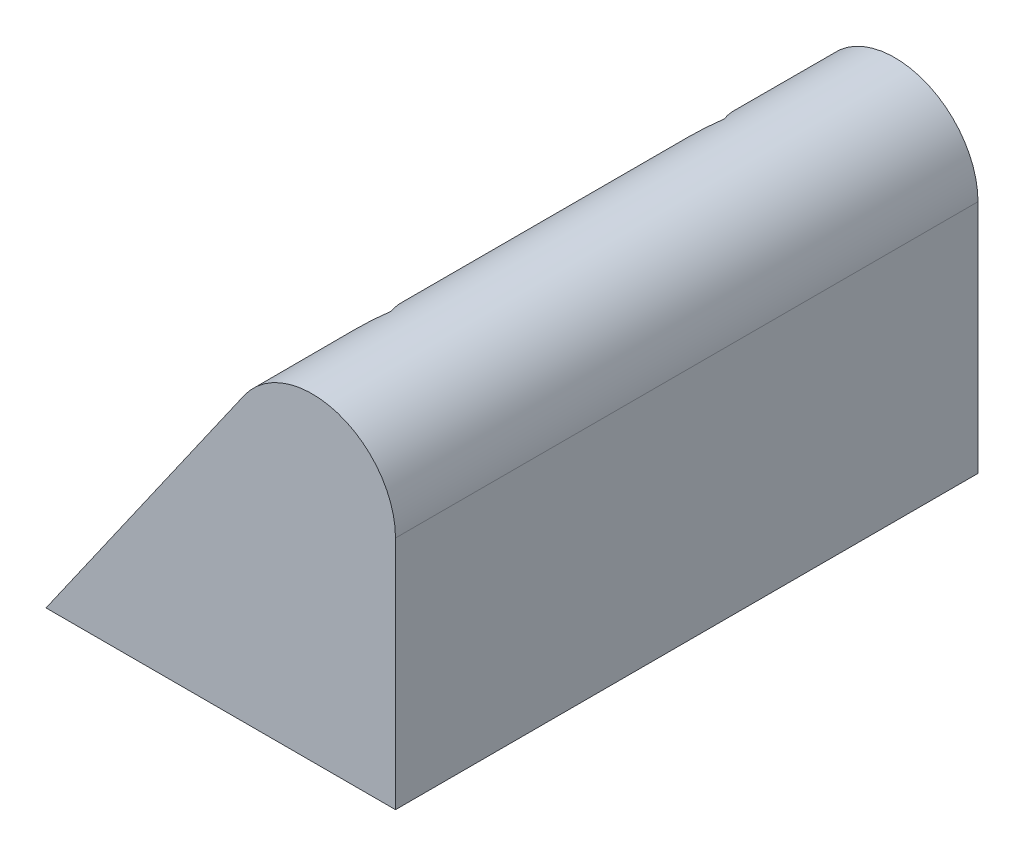
ISO-10303-21;
HEADER;
FILE_DESCRIPTION(('STEP AP214'),'2;1');
FILE_NAME('part.step','',(''),(''),'','','');
FILE_SCHEMA(('AUTOMOTIVE_DESIGN { 1 0 10303 214 1 1 1 1 }'));
ENDSEC;
DATA;
#1=APPLICATION_CONTEXT('core data for automotive mechanical design processes');
#2=APPLICATION_PROTOCOL_DEFINITION('international standard','automotive_design',2000,#1);
#3=PRODUCT_CONTEXT('',#1,'mechanical');
#4=PRODUCT('Part','Part','',(#3));
#5=PRODUCT_RELATED_PRODUCT_CATEGORY('part','',(#4));
#6=PRODUCT_DEFINITION_FORMATION('','',#4);
#7=PRODUCT_DEFINITION_CONTEXT('part definition',#1,'design');
#8=PRODUCT_DEFINITION('design','',#6,#7);
#9=PRODUCT_DEFINITION_SHAPE('','',#8);
#10=(LENGTH_UNIT() NAMED_UNIT(*) SI_UNIT(.MILLI.,.METRE.));
#11=(NAMED_UNIT(*) PLANE_ANGLE_UNIT() SI_UNIT($,.RADIAN.));
#12=(NAMED_UNIT(*) SI_UNIT($,.STERADIAN.) SOLID_ANGLE_UNIT());
#13=UNCERTAINTY_MEASURE_WITH_UNIT(LENGTH_MEASURE(1.E-05),#10,'distance_accuracy_value','');
#14=(GEOMETRIC_REPRESENTATION_CONTEXT(3) GLOBAL_UNCERTAINTY_ASSIGNED_CONTEXT((#13)) GLOBAL_UNIT_ASSIGNED_CONTEXT((#10,
#11,#12)) REPRESENTATION_CONTEXT('',''));
#15=CARTESIAN_POINT('',(0.,0.,0.));
#16=DIRECTION('',(0.,0.,1.));
#17=DIRECTION('',(1.,0.,0.));
#18=AXIS2_PLACEMENT_3D('',#15,#16,#17);
#19=CARTESIAN_POINT('',(21.,0.,35.));
#20=DIRECTION('',(0.,1.,0.));
#21=DIRECTION('',(-1.,0.,0.));
#22=AXIS2_PLACEMENT_3D('',#19,#20,#21);
#23=PLANE('',#22);
#24=CARTESIAN_POINT('',(10.,0.,27.5));
#25=DIRECTION('',(0.,-1.,0.));
#26=DIRECTION('',(1.,0.,0.));
#27=AXIS2_PLACEMENT_3D('',#24,#25,#26);
#28=CIRCLE('',#27,1.6);
#29=CARTESIAN_POINT('',(11.6,0.,27.5));
#30=VERTEX_POINT('',#29);
#31=EDGE_CURVE('E234',#30,#30,#28,.T.);
#32=ORIENTED_EDGE('',*,*,#31,.F.);
#33=EDGE_LOOP('',(#32));
#34=FACE_BOUND('',#33,.T.);
#35=CARTESIAN_POINT('',(10.,0.,7.5));
#36=DIRECTION('',(0.,-1.,0.));
#37=DIRECTION('',(-1.,0.,0.));
#38=AXIS2_PLACEMENT_3D('',#35,#36,#37);
#39=CIRCLE('',#38,1.6);
#40=CARTESIAN_POINT('',(8.4,0.,7.5));
#41=VERTEX_POINT('',#40);
#42=EDGE_CURVE('E238',#41,#41,#39,.T.);
#43=ORIENTED_EDGE('',*,*,#42,.F.);
#44=EDGE_LOOP('',(#43));
#45=FACE_BOUND('',#44,.T.);
#46=DIRECTION('',(1.,0.,0.));
#47=VECTOR('',#46,1.);
#48=CARTESIAN_POINT('',(21.,0.,0.));
#49=LINE('',#48,#47);
#50=CARTESIAN_POINT('',(0.,0.,0.));
#51=VERTEX_POINT('',#50);
#52=CARTESIAN_POINT('',(21.,0.,0.));
#53=VERTEX_POINT('',#52);
#54=EDGE_CURVE('E237',#51,#53,#49,.T.);
#55=ORIENTED_EDGE('',*,*,#54,.T.);
#56=DIRECTION('',(0.,0.,-1.));
#57=VECTOR('',#56,1.);
#58=CARTESIAN_POINT('',(21.,0.,35.));
#59=LINE('',#58,#57);
#60=CARTESIAN_POINT('',(21.,0.,35.));
#61=VERTEX_POINT('',#60);
#62=EDGE_CURVE('E258',#61,#53,#59,.T.);
#63=ORIENTED_EDGE('',*,*,#62,.F.);
#64=DIRECTION('',(1.,0.,0.));
#65=VECTOR('',#64,1.);
#66=CARTESIAN_POINT('',(21.,0.,35.));
#67=LINE('',#66,#65);
#68=CARTESIAN_POINT('',(0.,0.,35.));
#69=VERTEX_POINT('',#68);
#70=EDGE_CURVE('E242',#69,#61,#67,.T.);
#71=ORIENTED_EDGE('',*,*,#70,.F.);
#72=DIRECTION('',(0.,0.,-1.));
#73=VECTOR('',#72,1.);
#74=CARTESIAN_POINT('',(0.,0.,35.));
#75=LINE('',#74,#73);
#76=EDGE_CURVE('E250',#69,#51,#75,.T.);
#77=ORIENTED_EDGE('',*,*,#76,.T.);
#78=EDGE_LOOP('',(#55,#63,#71,#77));
#79=FACE_BOUND('',#78,.T.);
#80=ADVANCED_FACE('F33',(#34,#45,#79),#23,.F.);
#81=CARTESIAN_POINT('',(21.,30.,35.));
#82=DIRECTION('',(-1.,0.,0.));
#83=DIRECTION('',(0.,-1.,0.));
#84=AXIS2_PLACEMENT_3D('',#81,#82,#83);
#85=PLANE('',#84);
#86=DIRECTION('',(0.,1.,0.));
#87=VECTOR('',#86,1.);
#88=CARTESIAN_POINT('',(21.,30.,0.));
#89=LINE('',#88,#87);
#90=CARTESIAN_POINT('',(21.,14.1381745601902,0.));
#91=VERTEX_POINT('',#90);
#92=EDGE_CURVE('E253',#53,#91,#89,.T.);
#93=ORIENTED_EDGE('',*,*,#92,.T.);
#94=DIRECTION('',(0.,0.,-1.));
#95=VECTOR('',#94,1.);
#96=CARTESIAN_POINT('',(21.,14.1381745601902,35.));
#97=LINE('',#96,#95);
#98=CARTESIAN_POINT('',(21.,14.1381745601902,35.));
#99=VERTEX_POINT('',#98);
#100=EDGE_CURVE('E41',#91,#99,#97,.F.);
#101=ORIENTED_EDGE('',*,*,#100,.T.);
#102=DIRECTION('',(0.,1.,0.));
#103=VECTOR('',#102,1.);
#104=CARTESIAN_POINT('',(21.,30.,35.));
#105=LINE('',#104,#103);
#106=EDGE_CURVE('E245',#61,#99,#105,.T.);
#107=ORIENTED_EDGE('',*,*,#106,.F.);
#108=ORIENTED_EDGE('',*,*,#62,.T.);
#109=EDGE_LOOP('',(#93,#101,#107,#108));
#110=FACE_BOUND('',#109,.T.);
#111=ADVANCED_FACE('F333',(#110),#85,.F.);
#112=CARTESIAN_POINT('',(0.,0.,35.));
#113=DIRECTION('',(0.81923192051904,-0.573462344363328,0.));
#114=DIRECTION('',(0.573462344363328,0.81923192051904,0.));
#115=AXIS2_PLACEMENT_3D('',#112,#113,#114);
#116=PLANE('',#115);
#117=DIRECTION('',(-0.573462344363328,-0.81923192051904,0.));
#118=VECTOR('',#117,1.);
#119=CARTESIAN_POINT('',(0.,0.,35.));
#120=LINE('',#119,#118);
#121=CARTESIAN_POINT('',(11.9038403974048,17.0054862820068,35.));
#122=VERTEX_POINT('',#121);
#123=EDGE_CURVE('E248',#122,#69,#120,.T.);
#124=ORIENTED_EDGE('',*,*,#123,.F.);
#125=DIRECTION('',(0.,0.,-1.));
#126=VECTOR('',#125,1.);
#127=CARTESIAN_POINT('',(11.9038403974048,17.0054862820069,35.));
#128=LINE('',#127,#126);
#129=CARTESIAN_POINT('',(11.9038403974048,17.0054862820068,29.8024517021928));
#130=VERTEX_POINT('',#129);
#131=EDGE_CURVE('E303',#122,#130,#128,.T.);
#132=ORIENTED_EDGE('',*,*,#131,.T.);
#133=DIRECTION('',(-0.406866735603367,-0.581238193719096,0.704713857974726));
#134=VECTOR('',#133,1.);
#135=CARTESIAN_POINT('',(4.42143942505182,6.31634203578831,42.7623503489109));
#136=LINE('',#135,#134);
#137=CARTESIAN_POINT('',(11.616580753731,16.5951153624728,30.3));
#138=VERTEX_POINT('',#137);
#139=EDGE_CURVE('E282',#130,#138,#136,.T.);
#140=ORIENTED_EDGE('',*,*,#139,.T.);
#141=DIRECTION('',(-0.573462344363328,-0.81923192051904,0.));
#142=VECTOR('',#141,1.);
#143=CARTESIAN_POINT('',(0.,0.,30.3));
#144=LINE('',#143,#142);
#145=CARTESIAN_POINT('',(8.38341924626905,11.9763132089558,30.3));
#146=VERTEX_POINT('',#145);
#147=EDGE_CURVE('E284',#138,#146,#144,.T.);
#148=ORIENTED_EDGE('',*,*,#147,.T.);
#149=DIRECTION('',(-0.406866735603367,-0.581238193719096,-0.704713857974726));
#150=VECTOR('',#149,1.);
#151=CARTESIAN_POINT('',(5.51099300738062,7.87284715340088,25.3248118132513));
#152=LINE('',#151,#150);
#153=CARTESIAN_POINT('',(6.76683849253809,9.66691213219728,27.5));
#154=VERTEX_POINT('',#153);
#155=EDGE_CURVE('E287',#146,#154,#152,.T.);
#156=ORIENTED_EDGE('',*,*,#155,.T.);
#157=DIRECTION('',(0.406866735603367,0.581238193719096,-0.704713857974726));
#158=VECTOR('',#157,1.);
#159=CARTESIAN_POINT('',(1.21012360345114,1.7287480049302,37.1245125110731));
#160=LINE('',#159,#158);
#161=CARTESIAN_POINT('',(8.38341924626904,11.9763132089558,24.7));
#162=VERTEX_POINT('',#161);
#163=EDGE_CURVE('E290',#154,#162,#160,.T.);
#164=ORIENTED_EDGE('',*,*,#163,.T.);
#165=DIRECTION('',(0.573462344363328,0.81923192051904,0.));
#166=VECTOR('',#165,1.);
#167=CARTESIAN_POINT('',(0.,0.,24.7));
#168=LINE('',#167,#166);
#169=CARTESIAN_POINT('',(11.6165807537309,16.5951153624728,24.7));
#170=VERTEX_POINT('',#169);
#171=EDGE_CURVE('E293',#162,#170,#168,.T.);
#172=ORIENTED_EDGE('',*,*,#171,.T.);
#173=DIRECTION('',(0.406866735603368,0.581238193719097,0.704713857974725));
#174=VECTOR('',#173,1.);
#175=CARTESIAN_POINT('',(8.72230882898128,12.460441184259,19.6869739754134));
#176=LINE('',#175,#174);
#177=CARTESIAN_POINT('',(11.9038403974048,17.0054862820069,25.1975482978072));
#178=VERTEX_POINT('',#177);
#179=EDGE_CURVE('E296',#170,#178,#176,.T.);
#180=ORIENTED_EDGE('',*,*,#179,.T.);
#181=DIRECTION('',(0.,0.,-1.));
#182=VECTOR('',#181,1.);
#183=CARTESIAN_POINT('',(11.9038403974048,17.0054862820069,35.));
#184=LINE('',#183,#182);
#185=CARTESIAN_POINT('',(11.9038403974048,17.0054862820069,9.80245170219278));
#186=VERTEX_POINT('',#185);
#187=EDGE_CURVE('E301',#178,#186,#184,.T.);
#188=ORIENTED_EDGE('',*,*,#187,.T.);
#189=DIRECTION('',(-0.406866735603367,-0.581238193719095,0.704713857974727));
#190=VECTOR('',#189,1.);
#191=CARTESIAN_POINT('',(-1.31305311352079,-1.87579016217256,32.6947827813434));
#192=LINE('',#191,#190);
#193=CARTESIAN_POINT('',(11.616580753731,16.5951153624728,10.3));
#194=VERTEX_POINT('',#193);
#195=EDGE_CURVE('E261',#186,#194,#192,.T.);
#196=ORIENTED_EDGE('',*,*,#195,.T.);
#197=DIRECTION('',(-0.573462344363328,-0.81923192051904,0.));
#198=VECTOR('',#197,1.);
#199=CARTESIAN_POINT('',(0.,0.,10.3));
#200=LINE('',#199,#198);
#201=CARTESIAN_POINT('',(8.38341924626905,11.9763132089558,10.3));
#202=VERTEX_POINT('',#201);
#203=EDGE_CURVE('E267',#194,#202,#200,.T.);
#204=ORIENTED_EDGE('',*,*,#203,.T.);
#205=DIRECTION('',(-0.406866735603368,-0.581238193719096,-0.704713857974726));
#206=VECTOR('',#205,1.);
#207=CARTESIAN_POINT('',(11.2454855459533,16.0649793513618,15.2572442456837));
#208=LINE('',#207,#206);
#209=CARTESIAN_POINT('',(6.76683849253809,9.66691213219728,7.5));
#210=VERTEX_POINT('',#209);
#211=EDGE_CURVE('E270',#202,#210,#208,.T.);
#212=ORIENTED_EDGE('',*,*,#211,.T.);
#213=DIRECTION('',(0.406866735603367,0.581238193719096,-0.704713857974726));
#214=VECTOR('',#213,1.);
#215=CARTESIAN_POINT('',(-4.52436893512149,-6.4633841930307,27.0569449435055));
#216=LINE('',#215,#214);
#217=CARTESIAN_POINT('',(8.38341924626904,11.9763132089558,4.7));
#218=VERTEX_POINT('',#217);
#219=EDGE_CURVE('E273',#210,#218,#216,.T.);
#220=ORIENTED_EDGE('',*,*,#219,.T.);
#221=DIRECTION('',(0.573462344363328,0.81923192051904,0.));
#222=VECTOR('',#221,1.);
#223=CARTESIAN_POINT('',(0.,0.,4.7));
#224=LINE('',#223,#222);
#225=CARTESIAN_POINT('',(11.616580753731,16.5951153624728,4.69999999999999));
#226=VERTEX_POINT('',#225);
#227=EDGE_CURVE('E276',#218,#226,#224,.T.);
#228=ORIENTED_EDGE('',*,*,#227,.T.);
#229=DIRECTION('',(0.406866735603368,0.581238193719096,0.704713857974725));
#230=VECTOR('',#229,1.);
#231=CARTESIAN_POINT('',(14.4568013675539,20.6525733822199,9.61940640784585));
#232=LINE('',#231,#230);
#233=CARTESIAN_POINT('',(11.9038403974048,17.0054862820068,5.19754829780722));
#234=VERTEX_POINT('',#233);
#235=EDGE_CURVE('E279',#226,#234,#232,.T.);
#236=ORIENTED_EDGE('',*,*,#235,.T.);
#237=DIRECTION('',(0.,0.,-1.));
#238=VECTOR('',#237,1.);
#239=CARTESIAN_POINT('',(11.9038403974048,17.0054862820069,35.));
#240=LINE('',#239,#238);
#241=CARTESIAN_POINT('',(11.9038403974048,17.0054862820068,0.));
#242=VERTEX_POINT('',#241);
#243=EDGE_CURVE('E299',#234,#242,#240,.T.);
#244=ORIENTED_EDGE('',*,*,#243,.T.);
#245=DIRECTION('',(-0.573462344363328,-0.81923192051904,0.));
#246=VECTOR('',#245,1.);
#247=CARTESIAN_POINT('',(0.,0.,0.));
#248=LINE('',#247,#246);
#249=EDGE_CURVE('E246',#242,#51,#248,.T.);
#250=ORIENTED_EDGE('',*,*,#249,.T.);
#251=ORIENTED_EDGE('',*,*,#76,.F.);
#252=EDGE_LOOP('',(#124,#132,#140,#148,#156,#164,#172,#180,#188,#196,#204,#212,#220,#228,#236,
#244,#250,#251));
#253=FACE_BOUND('',#252,.T.);
#254=ADVANCED_FACE('F323',(#253),#116,.F.);
#255=CARTESIAN_POINT('',(0.,0.,35.));
#256=DIRECTION('',(0.,0.,1.));
#257=DIRECTION('',(1.,0.,0.));
#258=AXIS2_PLACEMENT_3D('',#255,#256,#257);
#259=PLANE('',#258);
#260=ORIENTED_EDGE('',*,*,#106,.T.);
#261=CARTESIAN_POINT('',(16.,14.1381745601902,35.));
#262=DIRECTION('',(0.,0.,1.));
#263=DIRECTION('',(1.,0.,0.));
#264=AXIS2_PLACEMENT_3D('',#261,#262,#263);
#265=CIRCLE('',#264,5.);
#266=EDGE_CURVE('E11',#99,#122,#265,.T.);
#267=ORIENTED_EDGE('',*,*,#266,.T.);
#268=ORIENTED_EDGE('',*,*,#123,.T.);
#269=ORIENTED_EDGE('',*,*,#70,.T.);
#270=EDGE_LOOP('',(#260,#267,#268,#269));
#271=FACE_BOUND('',#270,.T.);
#272=ADVANCED_FACE('F327',(#271),#259,.T.);
#273=CARTESIAN_POINT('',(0.,0.,0.));
#274=DIRECTION('',(0.,0.,1.));
#275=DIRECTION('',(1.,0.,0.));
#276=AXIS2_PLACEMENT_3D('',#273,#274,#275);
#277=PLANE('',#276);
#278=ORIENTED_EDGE('',*,*,#249,.F.);
#279=CARTESIAN_POINT('',(16.,14.1381745601902,0.));
#280=DIRECTION('',(0.,0.,1.));
#281=DIRECTION('',(1.,0.,0.));
#282=AXIS2_PLACEMENT_3D('',#279,#280,#281);
#283=CIRCLE('',#282,5.);
#284=EDGE_CURVE('E55',#242,#91,#283,.F.);
#285=ORIENTED_EDGE('',*,*,#284,.T.);
#286=ORIENTED_EDGE('',*,*,#92,.F.);
#287=ORIENTED_EDGE('',*,*,#54,.F.);
#288=EDGE_LOOP('',(#278,#285,#286,#287));
#289=FACE_BOUND('',#288,.T.);
#290=ADVANCED_FACE('F334',(#289),#277,.F.);
#291=CARTESIAN_POINT('',(10.,30.,7.5));
#292=DIRECTION('',(0.,-1.,0.));
#293=DIRECTION('',(1.,0.,0.));
#294=AXIS2_PLACEMENT_3D('',#291,#292,#293);
#295=CYLINDRICAL_SURFACE('',#294,1.6);
#296=CARTESIAN_POINT('',(10.,3.,7.5));
#297=DIRECTION('',(0.,-1.,0.));
#298=DIRECTION('',(1.,0.,0.));
#299=AXIS2_PLACEMENT_3D('',#296,#297,#298);
#300=CIRCLE('',#299,1.6);
#301=CARTESIAN_POINT('',(11.6,3.,7.5));
#302=VERTEX_POINT('',#301);
#303=EDGE_CURVE('E241',#302,#302,#300,.F.);
#304=ORIENTED_EDGE('',*,*,#303,.T.);
#305=EDGE_LOOP('',(#304));
#306=FACE_BOUND('',#305,.T.);
#307=ORIENTED_EDGE('',*,*,#42,.T.);
#308=EDGE_LOOP('',(#307));
#309=FACE_BOUND('',#308,.T.);
#310=ADVANCED_FACE('F336',(#306,#309),#295,.F.);
#311=CARTESIAN_POINT('',(10.,30.,27.5));
#312=DIRECTION('',(0.,-1.,0.));
#313=DIRECTION('',(1.,0.,0.));
#314=AXIS2_PLACEMENT_3D('',#311,#312,#313);
#315=CYLINDRICAL_SURFACE('',#314,1.6);
#316=CARTESIAN_POINT('',(10.,3.,27.5));
#317=DIRECTION('',(0.,-1.,0.));
#318=DIRECTION('',(1.,0.,0.));
#319=AXIS2_PLACEMENT_3D('',#316,#317,#318);
#320=CIRCLE('',#319,1.6);
#321=CARTESIAN_POINT('',(11.6,3.,27.5));
#322=VERTEX_POINT('',#321);
#323=EDGE_CURVE('E199',#322,#322,#320,.F.);
#324=ORIENTED_EDGE('',*,*,#323,.T.);
#325=EDGE_LOOP('',(#324));
#326=FACE_BOUND('',#325,.T.);
#327=ORIENTED_EDGE('',*,*,#31,.T.);
#328=EDGE_LOOP('',(#327));
#329=FACE_BOUND('',#328,.T.);
#330=ADVANCED_FACE('F342',(#326,#329),#315,.F.);
#331=CARTESIAN_POINT('',(11.6165807537309,30.,24.7));
#332=DIRECTION('',(0.866025403784438,0.,-0.5));
#333=DIRECTION('',(-0.5,0.,-0.866025403784439));
#334=AXIS2_PLACEMENT_3D('',#331,#332,#333);
#335=PLANE('',#334);
#336=DIRECTION('',(0.,-1.,0.));
#337=VECTOR('',#336,1.);
#338=CARTESIAN_POINT('',(13.2331615074619,30.,27.5));
#339=LINE('',#338,#337);
#340=CARTESIAN_POINT('',(13.2331615074619,18.3028599932343,27.5));
#341=VERTEX_POINT('',#340);
#342=CARTESIAN_POINT('',(13.2331615074619,3.,27.5));
#343=VERTEX_POINT('',#342);
#344=EDGE_CURVE('E157',#341,#343,#339,.T.);
#345=ORIENTED_EDGE('',*,*,#344,.F.);
#346=CARTESIAN_POINT('',(16.,14.1381745601902,32.2923048454133));
#347=DIRECTION('',(0.866025403784438,0.,-0.5));
#348=DIRECTION('',(-0.5,0.,-0.866025403784439));
#349=AXIS2_PLACEMENT_3D('',#346,#347,#348);
#350=ELLIPSE('',#349,9.99999999999999,5.);
#351=EDGE_CURVE('E307',#341,#178,#350,.F.);
#352=ORIENTED_EDGE('',*,*,#351,.T.);
#353=ORIENTED_EDGE('',*,*,#179,.F.);
#354=DIRECTION('',(0.,-1.,0.));
#355=VECTOR('',#354,1.);
#356=CARTESIAN_POINT('',(11.6165807537309,30.,24.7));
#357=LINE('',#356,#355);
#358=CARTESIAN_POINT('',(11.6165807537309,3.,24.7));
#359=VERTEX_POINT('',#358);
#360=EDGE_CURVE('E184',#170,#359,#357,.T.);
#361=ORIENTED_EDGE('',*,*,#360,.T.);
#362=DIRECTION('',(0.5,0.,0.866025403784439));
#363=VECTOR('',#362,1.);
#364=CARTESIAN_POINT('',(11.6165807537309,3.,24.7));
#365=LINE('',#364,#363);
#366=EDGE_CURVE('E176',#359,#343,#365,.T.);
#367=ORIENTED_EDGE('',*,*,#366,.T.);
#368=EDGE_LOOP('',(#345,#352,#353,#361,#367));
#369=FACE_BOUND('',#368,.T.);
#370=ADVANCED_FACE('F182',(#369),#335,.F.);
#371=CARTESIAN_POINT('',(8.38341924626904,30.,24.7));
#372=DIRECTION('',(0.,0.,-1.));
#373=DIRECTION('',(-1.,0.,0.));
#374=AXIS2_PLACEMENT_3D('',#371,#372,#373);
#375=PLANE('',#374);
#376=DIRECTION('',(0.,-1.,0.));
#377=VECTOR('',#376,1.);
#378=CARTESIAN_POINT('',(8.38341924626904,30.,24.7));
#379=LINE('',#378,#377);
#380=CARTESIAN_POINT('',(8.38341924626904,3.,24.7));
#381=VERTEX_POINT('',#380);
#382=EDGE_CURVE('E200',#162,#381,#379,.T.);
#383=ORIENTED_EDGE('',*,*,#382,.T.);
#384=DIRECTION('',(1.,0.,0.));
#385=VECTOR('',#384,1.);
#386=CARTESIAN_POINT('',(8.38341924626904,3.,24.7));
#387=LINE('',#386,#385);
#388=EDGE_CURVE('E168',#381,#359,#387,.T.);
#389=ORIENTED_EDGE('',*,*,#388,.T.);
#390=ORIENTED_EDGE('',*,*,#360,.F.);
#391=ORIENTED_EDGE('',*,*,#171,.F.);
#392=EDGE_LOOP('',(#383,#389,#390,#391));
#393=FACE_BOUND('',#392,.T.);
#394=ADVANCED_FACE('F378',(#393),#375,.F.);
#395=CARTESIAN_POINT('',(6.76683849253809,30.,27.5));
#396=DIRECTION('',(-0.866025403784439,0.,-0.5));
#397=DIRECTION('',(-0.5,0.,0.866025403784439));
#398=AXIS2_PLACEMENT_3D('',#395,#396,#397);
#399=PLANE('',#398);
#400=DIRECTION('',(0.,-1.,0.));
#401=VECTOR('',#400,1.);
#402=CARTESIAN_POINT('',(6.76683849253809,30.,27.5));
#403=LINE('',#402,#401);
#404=CARTESIAN_POINT('',(6.76683849253809,3.,27.5));
#405=VERTEX_POINT('',#404);
#406=EDGE_CURVE('E202',#154,#405,#403,.T.);
#407=ORIENTED_EDGE('',*,*,#406,.T.);
#408=DIRECTION('',(0.5,0.,-0.866025403784439));
#409=VECTOR('',#408,1.);
#410=CARTESIAN_POINT('',(6.76683849253809,3.,27.5));
#411=LINE('',#410,#409);
#412=EDGE_CURVE('E194',#405,#381,#411,.T.);
#413=ORIENTED_EDGE('',*,*,#412,.T.);
#414=ORIENTED_EDGE('',*,*,#382,.F.);
#415=ORIENTED_EDGE('',*,*,#163,.F.);
#416=EDGE_LOOP('',(#407,#413,#414,#415));
#417=FACE_BOUND('',#416,.T.);
#418=ADVANCED_FACE('F468',(#417),#399,.F.);
#419=CARTESIAN_POINT('',(8.38341924626905,30.,30.3));
#420=DIRECTION('',(-0.866025403784439,0.,0.5));
#421=DIRECTION('',(0.5,0.,0.866025403784439));
#422=AXIS2_PLACEMENT_3D('',#419,#420,#421);
#423=PLANE('',#422);
#424=DIRECTION('',(0.,-1.,0.));
#425=VECTOR('',#424,1.);
#426=CARTESIAN_POINT('',(8.38341924626905,30.,30.3));
#427=LINE('',#426,#425);
#428=CARTESIAN_POINT('',(8.38341924626905,3.,30.3));
#429=VERTEX_POINT('',#428);
#430=EDGE_CURVE('E204',#146,#429,#427,.T.);
#431=ORIENTED_EDGE('',*,*,#430,.T.);
#432=DIRECTION('',(-0.5,0.,-0.866025403784439));
#433=VECTOR('',#432,1.);
#434=CARTESIAN_POINT('',(8.38341924626905,3.,30.3));
#435=LINE('',#434,#433);
#436=EDGE_CURVE('E191',#429,#405,#435,.T.);
#437=ORIENTED_EDGE('',*,*,#436,.T.);
#438=ORIENTED_EDGE('',*,*,#406,.F.);
#439=ORIENTED_EDGE('',*,*,#155,.F.);
#440=EDGE_LOOP('',(#431,#437,#438,#439));
#441=FACE_BOUND('',#440,.T.);
#442=ADVANCED_FACE('F478',(#441),#423,.F.);
#443=CARTESIAN_POINT('',(11.616580753731,30.,30.3));
#444=DIRECTION('',(0.,0.,1.));
#445=DIRECTION('',(1.,0.,0.));
#446=AXIS2_PLACEMENT_3D('',#443,#444,#445);
#447=PLANE('',#446);
#448=DIRECTION('',(0.,-1.,0.));
#449=VECTOR('',#448,1.);
#450=CARTESIAN_POINT('',(11.616580753731,30.,30.3));
#451=LINE('',#450,#449);
#452=CARTESIAN_POINT('',(11.616580753731,3.,30.3));
#453=VERTEX_POINT('',#452);
#454=EDGE_CURVE('E167',#138,#453,#451,.T.);
#455=ORIENTED_EDGE('',*,*,#454,.T.);
#456=DIRECTION('',(-1.,0.,0.));
#457=VECTOR('',#456,1.);
#458=CARTESIAN_POINT('',(11.616580753731,3.,30.3));
#459=LINE('',#458,#457);
#460=EDGE_CURVE('E180',#453,#429,#459,.T.);
#461=ORIENTED_EDGE('',*,*,#460,.T.);
#462=ORIENTED_EDGE('',*,*,#430,.F.);
#463=ORIENTED_EDGE('',*,*,#147,.F.);
#464=EDGE_LOOP('',(#455,#461,#462,#463));
#465=FACE_BOUND('',#464,.T.);
#466=ADVANCED_FACE('F391',(#465),#447,.F.);
#467=CARTESIAN_POINT('',(13.2331615074619,30.,27.5));
#468=DIRECTION('',(0.866025403784439,0.,0.5));
#469=DIRECTION('',(0.5,0.,-0.866025403784439));
#470=AXIS2_PLACEMENT_3D('',#467,#468,#469);
#471=PLANE('',#470);
#472=ORIENTED_EDGE('',*,*,#139,.F.);
#473=CARTESIAN_POINT('',(16.,14.1381745601902,22.7076951545867));
#474=DIRECTION('',(0.866025403784439,0.,0.5));
#475=DIRECTION('',(0.5,0.,-0.866025403784439));
#476=AXIS2_PLACEMENT_3D('',#473,#474,#475);
#477=ELLIPSE('',#476,10.,5.);
#478=EDGE_CURVE('E163',#130,#341,#477,.F.);
#479=ORIENTED_EDGE('',*,*,#478,.T.);
#480=ORIENTED_EDGE('',*,*,#344,.T.);
#481=DIRECTION('',(-0.5,0.,0.866025403784439));
#482=VECTOR('',#481,1.);
#483=CARTESIAN_POINT('',(13.2331615074619,3.,27.5));
#484=LINE('',#483,#482);
#485=EDGE_CURVE('E162',#343,#453,#484,.T.);
#486=ORIENTED_EDGE('',*,*,#485,.T.);
#487=ORIENTED_EDGE('',*,*,#454,.F.);
#488=EDGE_LOOP('',(#472,#479,#480,#486,#487));
#489=FACE_BOUND('',#488,.T.);
#490=ADVANCED_FACE('F160',(#489),#471,.F.);
#491=CARTESIAN_POINT('',(0.,3.,0.));
#492=DIRECTION('',(0.,-1.,0.));
#493=DIRECTION('',(1.,0.,0.));
#494=AXIS2_PLACEMENT_3D('',#491,#492,#493);
#495=PLANE('',#494);
#496=ORIENTED_EDGE('',*,*,#366,.F.);
#497=ORIENTED_EDGE('',*,*,#388,.F.);
#498=ORIENTED_EDGE('',*,*,#412,.F.);
#499=ORIENTED_EDGE('',*,*,#436,.F.);
#500=ORIENTED_EDGE('',*,*,#460,.F.);
#501=ORIENTED_EDGE('',*,*,#485,.F.);
#502=EDGE_LOOP('',(#496,#497,#498,#499,#500,#501));
#503=FACE_BOUND('',#502,.T.);
#504=ORIENTED_EDGE('',*,*,#323,.F.);
#505=EDGE_LOOP('',(#504));
#506=FACE_BOUND('',#505,.T.);
#507=ADVANCED_FACE('F173',(#503,#506),#495,.F.);
#508=CARTESIAN_POINT('',(11.616580753731,30.,4.69999999999999));
#509=DIRECTION('',(0.866025403784439,0.,-0.5));
#510=DIRECTION('',(-0.5,0.,-0.866025403784439));
#511=AXIS2_PLACEMENT_3D('',#508,#509,#510);
#512=PLANE('',#511);
#513=DIRECTION('',(0.,-1.,0.));
#514=VECTOR('',#513,1.);
#515=CARTESIAN_POINT('',(13.2331615074619,30.,7.5));
#516=LINE('',#515,#514);
#517=CARTESIAN_POINT('',(13.2331615074619,18.3028599932343,7.5));
#518=VERTEX_POINT('',#517);
#519=CARTESIAN_POINT('',(13.2331615074619,3.,7.5));
#520=VERTEX_POINT('',#519);
#521=EDGE_CURVE('E224',#518,#520,#516,.T.);
#522=ORIENTED_EDGE('',*,*,#521,.F.);
#523=CARTESIAN_POINT('',(16.,14.1381745601902,12.2923048454132));
#524=DIRECTION('',(0.866025403784439,0.,-0.5));
#525=DIRECTION('',(-0.5,0.,-0.866025403784439));
#526=AXIS2_PLACEMENT_3D('',#523,#524,#525);
#527=ELLIPSE('',#526,9.99999999999999,5.);
#528=EDGE_CURVE('E311',#518,#234,#527,.F.);
#529=ORIENTED_EDGE('',*,*,#528,.T.);
#530=ORIENTED_EDGE('',*,*,#235,.F.);
#531=DIRECTION('',(0.,-1.,0.));
#532=VECTOR('',#531,1.);
#533=CARTESIAN_POINT('',(11.616580753731,30.,4.69999999999999));
#534=LINE('',#533,#532);
#535=CARTESIAN_POINT('',(11.616580753731,3.,4.69999999999999));
#536=VERTEX_POINT('',#535);
#537=EDGE_CURVE('E185',#226,#536,#534,.T.);
#538=ORIENTED_EDGE('',*,*,#537,.T.);
#539=DIRECTION('',(0.5,0.,0.866025403784438));
#540=VECTOR('',#539,1.);
#541=CARTESIAN_POINT('',(11.616580753731,3.,4.69999999999999));
#542=LINE('',#541,#540);
#543=EDGE_CURVE('E207',#536,#520,#542,.T.);
#544=ORIENTED_EDGE('',*,*,#543,.T.);
#545=EDGE_LOOP('',(#522,#529,#530,#538,#544));
#546=FACE_BOUND('',#545,.T.);
#547=ADVANCED_FACE('F316',(#546),#512,.F.);
#548=CARTESIAN_POINT('',(8.38341924626904,30.,4.69999999999999));
#549=DIRECTION('',(0.,0.,-1.));
#550=DIRECTION('',(-1.,0.,0.));
#551=AXIS2_PLACEMENT_3D('',#548,#549,#550);
#552=PLANE('',#551);
#553=DIRECTION('',(0.,-1.,0.));
#554=VECTOR('',#553,1.);
#555=CARTESIAN_POINT('',(8.38341924626904,30.,4.69999999999999));
#556=LINE('',#555,#554);
#557=CARTESIAN_POINT('',(8.38341924626905,3.,4.69999999999999));
#558=VERTEX_POINT('',#557);
#559=EDGE_CURVE('E187',#218,#558,#556,.T.);
#560=ORIENTED_EDGE('',*,*,#559,.T.);
#561=DIRECTION('',(1.,0.,0.));
#562=VECTOR('',#561,1.);
#563=CARTESIAN_POINT('',(8.38341924626905,3.,4.69999999999999));
#564=LINE('',#563,#562);
#565=EDGE_CURVE('E222',#558,#536,#564,.T.);
#566=ORIENTED_EDGE('',*,*,#565,.T.);
#567=ORIENTED_EDGE('',*,*,#537,.F.);
#568=ORIENTED_EDGE('',*,*,#227,.F.);
#569=EDGE_LOOP('',(#560,#566,#567,#568));
#570=FACE_BOUND('',#569,.T.);
#571=ADVANCED_FACE('F404',(#570),#552,.F.);
#572=CARTESIAN_POINT('',(6.76683849253809,30.,7.5));
#573=DIRECTION('',(-0.866025403784439,0.,-0.5));
#574=DIRECTION('',(-0.5,0.,0.866025403784439));
#575=AXIS2_PLACEMENT_3D('',#572,#573,#574);
#576=PLANE('',#575);
#577=DIRECTION('',(0.,-1.,0.));
#578=VECTOR('',#577,1.);
#579=CARTESIAN_POINT('',(6.76683849253809,30.,7.5));
#580=LINE('',#579,#578);
#581=CARTESIAN_POINT('',(6.76683849253809,3.,7.5));
#582=VERTEX_POINT('',#581);
#583=EDGE_CURVE('E227',#210,#582,#580,.T.);
#584=ORIENTED_EDGE('',*,*,#583,.T.);
#585=DIRECTION('',(0.5,0.,-0.866025403784439));
#586=VECTOR('',#585,1.);
#587=CARTESIAN_POINT('',(6.76683849253809,3.,7.5));
#588=LINE('',#587,#586);
#589=EDGE_CURVE('E219',#582,#558,#588,.T.);
#590=ORIENTED_EDGE('',*,*,#589,.T.);
#591=ORIENTED_EDGE('',*,*,#559,.F.);
#592=ORIENTED_EDGE('',*,*,#219,.F.);
#593=EDGE_LOOP('',(#584,#590,#591,#592));
#594=FACE_BOUND('',#593,.T.);
#595=ADVANCED_FACE('F508',(#594),#576,.F.);
#596=CARTESIAN_POINT('',(8.38341924626905,30.,10.3));
#597=DIRECTION('',(-0.866025403784439,0.,0.5));
#598=DIRECTION('',(0.5,0.,0.866025403784439));
#599=AXIS2_PLACEMENT_3D('',#596,#597,#598);
#600=PLANE('',#599);
#601=DIRECTION('',(0.,-1.,0.));
#602=VECTOR('',#601,1.);
#603=CARTESIAN_POINT('',(8.38341924626905,30.,10.3));
#604=LINE('',#603,#602);
#605=CARTESIAN_POINT('',(8.38341924626905,3.,10.3));
#606=VERTEX_POINT('',#605);
#607=EDGE_CURVE('E229',#202,#606,#604,.T.);
#608=ORIENTED_EDGE('',*,*,#607,.T.);
#609=DIRECTION('',(-0.5,0.,-0.866025403784439));
#610=VECTOR('',#609,1.);
#611=CARTESIAN_POINT('',(8.38341924626905,3.,10.3));
#612=LINE('',#611,#610);
#613=EDGE_CURVE('E216',#606,#582,#612,.T.);
#614=ORIENTED_EDGE('',*,*,#613,.T.);
#615=ORIENTED_EDGE('',*,*,#583,.F.);
#616=ORIENTED_EDGE('',*,*,#211,.F.);
#617=EDGE_LOOP('',(#608,#614,#615,#616));
#618=FACE_BOUND('',#617,.T.);
#619=ADVANCED_FACE('F517',(#618),#600,.F.);
#620=CARTESIAN_POINT('',(11.616580753731,30.,10.3));
#621=DIRECTION('',(0.,0.,1.));
#622=DIRECTION('',(1.,0.,0.));
#623=AXIS2_PLACEMENT_3D('',#620,#621,#622);
#624=PLANE('',#623);
#625=DIRECTION('',(0.,-1.,0.));
#626=VECTOR('',#625,1.);
#627=CARTESIAN_POINT('',(11.616580753731,30.,10.3));
#628=LINE('',#627,#626);
#629=CARTESIAN_POINT('',(11.616580753731,3.,10.3));
#630=VERTEX_POINT('',#629);
#631=EDGE_CURVE('E231',#194,#630,#628,.T.);
#632=ORIENTED_EDGE('',*,*,#631,.T.);
#633=DIRECTION('',(-1.,0.,0.));
#634=VECTOR('',#633,1.);
#635=CARTESIAN_POINT('',(11.616580753731,3.,10.3));
#636=LINE('',#635,#634);
#637=EDGE_CURVE('E213',#630,#606,#636,.T.);
#638=ORIENTED_EDGE('',*,*,#637,.T.);
#639=ORIENTED_EDGE('',*,*,#607,.F.);
#640=ORIENTED_EDGE('',*,*,#203,.F.);
#641=EDGE_LOOP('',(#632,#638,#639,#640));
#642=FACE_BOUND('',#641,.T.);
#643=ADVANCED_FACE('F417',(#642),#624,.F.);
#644=CARTESIAN_POINT('',(13.2331615074619,30.,7.5));
#645=DIRECTION('',(0.866025403784439,0.,0.499999999999999));
#646=DIRECTION('',(0.499999999999999,0.,-0.866025403784439));
#647=AXIS2_PLACEMENT_3D('',#644,#645,#646);
#648=PLANE('',#647);
#649=ORIENTED_EDGE('',*,*,#195,.F.);
#650=CARTESIAN_POINT('',(16.,14.1381745601902,2.70769515458674));
#651=DIRECTION('',(0.866025403784439,0.,0.499999999999999));
#652=DIRECTION('',(0.499999999999999,0.,-0.866025403784439));
#653=AXIS2_PLACEMENT_3D('',#650,#651,#652);
#654=ELLIPSE('',#653,10.,5.);
#655=EDGE_CURVE('E309',#186,#518,#654,.F.);
#656=ORIENTED_EDGE('',*,*,#655,.T.);
#657=ORIENTED_EDGE('',*,*,#521,.T.);
#658=DIRECTION('',(-0.499999999999999,0.,0.866025403784439));
#659=VECTOR('',#658,1.);
#660=CARTESIAN_POINT('',(13.2331615074619,3.,7.5));
#661=LINE('',#660,#659);
#662=EDGE_CURVE('E210',#520,#630,#661,.T.);
#663=ORIENTED_EDGE('',*,*,#662,.T.);
#664=ORIENTED_EDGE('',*,*,#631,.F.);
#665=EDGE_LOOP('',(#649,#656,#657,#663,#664));
#666=FACE_BOUND('',#665,.T.);
#667=ADVANCED_FACE('F411',(#666),#648,.F.);
#668=CARTESIAN_POINT('',(0.,3.,0.));
#669=DIRECTION('',(0.,-1.,0.));
#670=DIRECTION('',(1.,0.,0.));
#671=AXIS2_PLACEMENT_3D('',#668,#669,#670);
#672=PLANE('',#671);
#673=ORIENTED_EDGE('',*,*,#543,.F.);
#674=ORIENTED_EDGE('',*,*,#565,.F.);
#675=ORIENTED_EDGE('',*,*,#589,.F.);
#676=ORIENTED_EDGE('',*,*,#613,.F.);
#677=ORIENTED_EDGE('',*,*,#637,.F.);
#678=ORIENTED_EDGE('',*,*,#662,.F.);
#679=EDGE_LOOP('',(#673,#674,#675,#676,#677,#678));
#680=FACE_BOUND('',#679,.T.);
#681=ORIENTED_EDGE('',*,*,#303,.F.);
#682=EDGE_LOOP('',(#681));
#683=FACE_BOUND('',#682,.T.);
#684=ADVANCED_FACE('F416',(#680,#683),#672,.F.);
#685=CARTESIAN_POINT('',(16.,14.1381745601902,35.));
#686=DIRECTION('',(0.,0.,-1.));
#687=DIRECTION('',(-1.,0.,0.));
#688=AXIS2_PLACEMENT_3D('',#685,#686,#687);
#689=CYLINDRICAL_SURFACE('',#688,5.);
#690=ORIENTED_EDGE('',*,*,#266,.F.);
#691=ORIENTED_EDGE('',*,*,#100,.F.);
#692=ORIENTED_EDGE('',*,*,#284,.F.);
#693=ORIENTED_EDGE('',*,*,#243,.F.);
#694=ORIENTED_EDGE('',*,*,#528,.F.);
#695=ORIENTED_EDGE('',*,*,#655,.F.);
#696=ORIENTED_EDGE('',*,*,#187,.F.);
#697=ORIENTED_EDGE('',*,*,#351,.F.);
#698=ORIENTED_EDGE('',*,*,#478,.F.);
#699=ORIENTED_EDGE('',*,*,#131,.F.);
#700=EDGE_LOOP('',(#690,#691,#692,#693,#694,#695,#696,#697,#698,#699));
#701=FACE_BOUND('',#700,.T.);
#702=ADVANCED_FACE('F35',(#701),#689,.T.);
#703=CLOSED_SHELL('',(#80,#111,#254,#272,#290,#310,#330,#370,#394,#418,#442,#466,#490,#507,#547,
#571,#595,#619,#643,#667,#684,#702));
#704=MANIFOLD_SOLID_BREP('B2',#703);
#705=ADVANCED_BREP_SHAPE_REPRESENTATION('',(#18,#704),#14);
#706=SHAPE_DEFINITION_REPRESENTATION(#9,#705);
ENDSEC;
END-ISO-10303-21;
